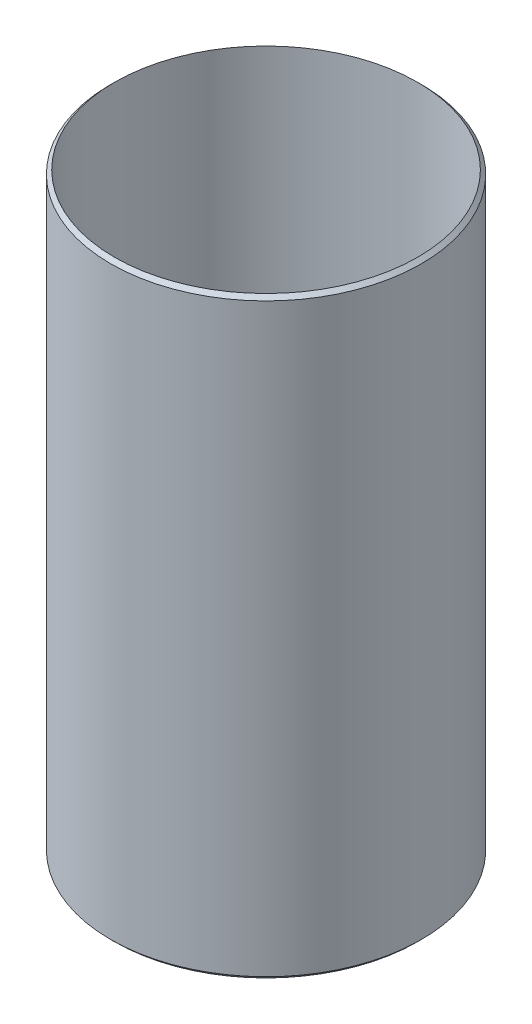
ISO-10303-21;
HEADER;
FILE_DESCRIPTION(('STEP AP214'),'2;1');
FILE_NAME('part.step','',(''),(''),'','','');
FILE_SCHEMA(('AUTOMOTIVE_DESIGN { 1 0 10303 214 1 1 1 1 }'));
ENDSEC;
DATA;
#1=APPLICATION_CONTEXT('core data for automotive mechanical design processes');
#2=APPLICATION_PROTOCOL_DEFINITION('international standard','automotive_design',2000,#1);
#3=PRODUCT_CONTEXT('',#1,'mechanical');
#4=PRODUCT('Part','Part','',(#3));
#5=PRODUCT_RELATED_PRODUCT_CATEGORY('part','',(#4));
#6=PRODUCT_DEFINITION_FORMATION('','',#4);
#7=PRODUCT_DEFINITION_CONTEXT('part definition',#1,'design');
#8=PRODUCT_DEFINITION('design','',#6,#7);
#9=PRODUCT_DEFINITION_SHAPE('','',#8);
#10=(LENGTH_UNIT() NAMED_UNIT(*) SI_UNIT(.MILLI.,.METRE.));
#11=(NAMED_UNIT(*) PLANE_ANGLE_UNIT() SI_UNIT($,.RADIAN.));
#12=(NAMED_UNIT(*) SI_UNIT($,.STERADIAN.) SOLID_ANGLE_UNIT());
#13=UNCERTAINTY_MEASURE_WITH_UNIT(LENGTH_MEASURE(1.E-05),#10,'distance_accuracy_value','');
#14=(GEOMETRIC_REPRESENTATION_CONTEXT(3) GLOBAL_UNCERTAINTY_ASSIGNED_CONTEXT((#13)) GLOBAL_UNIT_ASSIGNED_CONTEXT((#10,
#11,#12)) REPRESENTATION_CONTEXT('',''));
#15=CARTESIAN_POINT('',(0.,0.,0.));
#16=DIRECTION('',(0.,0.,1.));
#17=DIRECTION('',(1.,0.,0.));
#18=AXIS2_PLACEMENT_3D('',#15,#16,#17);
#19=CARTESIAN_POINT('',(0.,315.,0.));
#20=DIRECTION('',(0.,-1.,0.));
#21=DIRECTION('',(0.,0.,-1.));
#22=AXIS2_PLACEMENT_3D('',#19,#20,#21);
#23=CYLINDRICAL_SURFACE('',#22,82.55);
#24=CARTESIAN_POINT('',(0.,1.99999999999995,0.));
#25=DIRECTION('',(0.,1.,0.));
#26=DIRECTION('',(0.,0.,1.));
#27=AXIS2_PLACEMENT_3D('',#24,#25,#26);
#28=CIRCLE('',#27,82.55);
#29=CARTESIAN_POINT('',(0.,1.99999999999995,82.55));
#30=VERTEX_POINT('',#29);
#31=EDGE_CURVE('E10',#30,#30,#28,.T.);
#32=ORIENTED_EDGE('',*,*,#31,.T.);
#33=EDGE_LOOP('',(#32));
#34=FACE_BOUND('',#33,.T.);
#35=CARTESIAN_POINT('',(0.,313.,0.));
#36=DIRECTION('',(0.,1.,0.));
#37=DIRECTION('',(0.,0.,1.));
#38=AXIS2_PLACEMENT_3D('',#35,#36,#37);
#39=CIRCLE('',#38,82.55);
#40=CARTESIAN_POINT('',(0.,313.,82.55));
#41=VERTEX_POINT('',#40);
#42=EDGE_CURVE('E41',#41,#41,#39,.F.);
#43=ORIENTED_EDGE('',*,*,#42,.T.);
#44=EDGE_LOOP('',(#43));
#45=FACE_BOUND('',#44,.T.);
#46=ADVANCED_FACE('F34',(#34,#45),#23,.T.);
#47=CARTESIAN_POINT('',(0.,315.,0.));
#48=DIRECTION('',(0.,-1.,0.));
#49=DIRECTION('',(0.,0.,-1.));
#50=AXIS2_PLACEMENT_3D('',#47,#48,#49);
#51=CYLINDRICAL_SURFACE('',#50,80.55);
#52=CARTESIAN_POINT('',(0.,315.,0.));
#53=DIRECTION('',(0.,1.,0.));
#54=DIRECTION('',(0.,0.,1.));
#55=AXIS2_PLACEMENT_3D('',#52,#53,#54);
#56=CIRCLE('',#55,80.55);
#57=CARTESIAN_POINT('',(0.,315.,80.55));
#58=VERTEX_POINT('',#57);
#59=EDGE_CURVE('E45',#58,#58,#56,.T.);
#60=ORIENTED_EDGE('',*,*,#59,.T.);
#61=EDGE_LOOP('',(#60));
#62=FACE_BOUND('',#61,.T.);
#63=CARTESIAN_POINT('',(0.,0.,0.));
#64=DIRECTION('',(0.,1.,0.));
#65=DIRECTION('',(0.,0.,1.));
#66=AXIS2_PLACEMENT_3D('',#63,#64,#65);
#67=CIRCLE('',#66,80.55);
#68=CARTESIAN_POINT('',(0.,0.,80.55));
#69=VERTEX_POINT('',#68);
#70=EDGE_CURVE('E49',#69,#69,#67,.T.);
#71=ORIENTED_EDGE('',*,*,#70,.F.);
#72=EDGE_LOOP('',(#71));
#73=FACE_BOUND('',#72,.T.);
#74=ADVANCED_FACE('F58',(#62,#73),#51,.F.);
#75=CARTESIAN_POINT('',(0.,1.99999999999995,0.));
#76=DIRECTION('',(0.,1.,0.));
#77=DIRECTION('',(0.,0.,1.));
#78=AXIS2_PLACEMENT_3D('',#75,#76,#77);
#79=CONICAL_SURFACE('',#78,82.55,0.785398163397452);
#80=ORIENTED_EDGE('',*,*,#70,.T.);
#81=EDGE_LOOP('',(#80));
#82=FACE_BOUND('',#81,.T.);
#83=ORIENTED_EDGE('',*,*,#31,.F.);
#84=EDGE_LOOP('',(#83));
#85=FACE_BOUND('',#84,.T.);
#86=ADVANCED_FACE('F55',(#82,#85),#79,.T.);
#87=CARTESIAN_POINT('',(0.,315.,0.));
#88=DIRECTION('',(0.,-1.,0.));
#89=DIRECTION('',(0.,0.,-1.));
#90=AXIS2_PLACEMENT_3D('',#87,#88,#89);
#91=CONICAL_SURFACE('',#90,80.5500000000001,0.785398163397445);
#92=ORIENTED_EDGE('',*,*,#42,.F.);
#93=EDGE_LOOP('',(#92));
#94=FACE_BOUND('',#93,.T.);
#95=ORIENTED_EDGE('',*,*,#59,.F.);
#96=EDGE_LOOP('',(#95));
#97=FACE_BOUND('',#96,.T.);
#98=ADVANCED_FACE('F36',(#94,#97),#91,.T.);
#99=CLOSED_SHELL('',(#46,#74,#86,#98));
#100=MANIFOLD_SOLID_BREP('B2',#99);
#101=ADVANCED_BREP_SHAPE_REPRESENTATION('',(#18,#100),#14);
#102=SHAPE_DEFINITION_REPRESENTATION(#9,#101);
ENDSEC;
END-ISO-10303-21;
